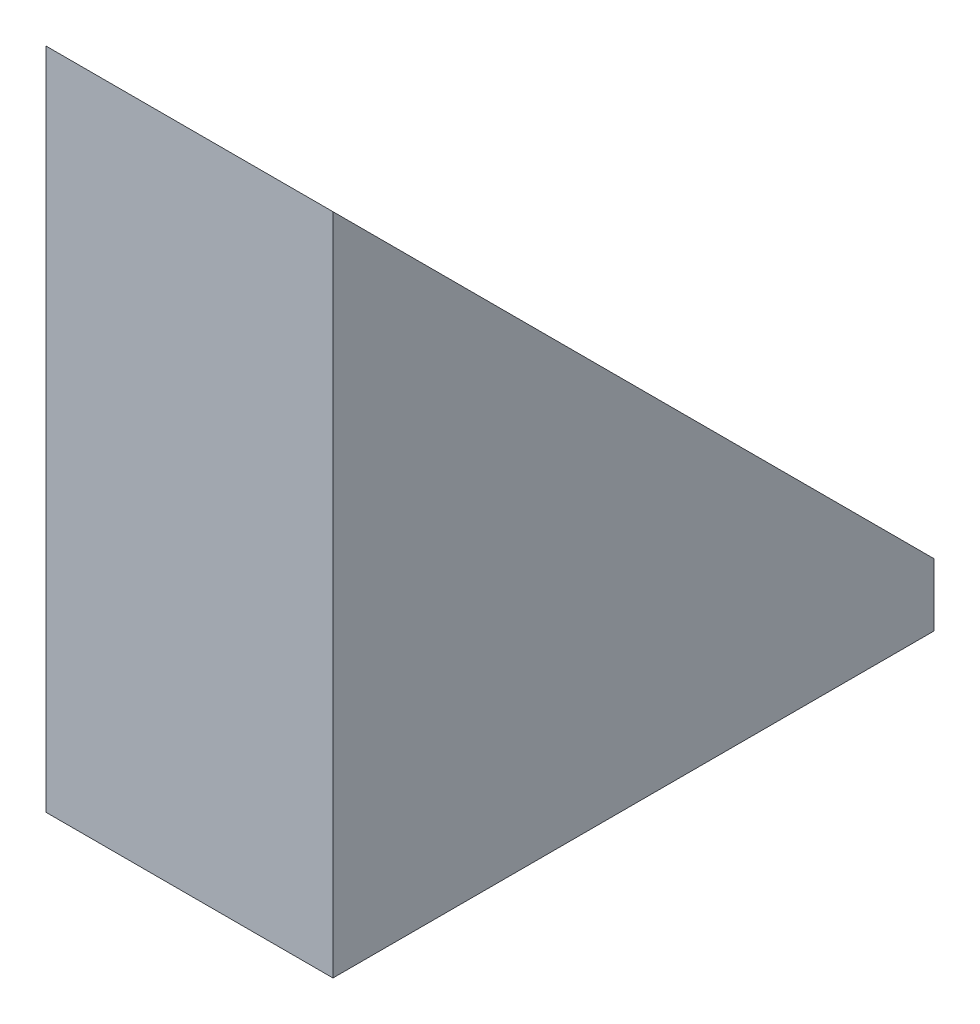
ISO-10303-21;
HEADER;
FILE_DESCRIPTION(('STEP AP214'),'2;1');
FILE_NAME('part.step','',(''),(''),'','','');
FILE_SCHEMA(('AUTOMOTIVE_DESIGN { 1 0 10303 214 1 1 1 1 }'));
ENDSEC;
DATA;
#1=APPLICATION_CONTEXT('core data for automotive mechanical design processes');
#2=APPLICATION_PROTOCOL_DEFINITION('international standard','automotive_design',2000,#1);
#3=PRODUCT_CONTEXT('',#1,'mechanical');
#4=PRODUCT('Part','Part','',(#3));
#5=PRODUCT_RELATED_PRODUCT_CATEGORY('part','',(#4));
#6=PRODUCT_DEFINITION_FORMATION('','',#4);
#7=PRODUCT_DEFINITION_CONTEXT('part definition',#1,'design');
#8=PRODUCT_DEFINITION('design','',#6,#7);
#9=PRODUCT_DEFINITION_SHAPE('','',#8);
#10=(LENGTH_UNIT() NAMED_UNIT(*) SI_UNIT(.MILLI.,.METRE.));
#11=(NAMED_UNIT(*) PLANE_ANGLE_UNIT() SI_UNIT($,.RADIAN.));
#12=(NAMED_UNIT(*) SI_UNIT($,.STERADIAN.) SOLID_ANGLE_UNIT());
#13=UNCERTAINTY_MEASURE_WITH_UNIT(LENGTH_MEASURE(1.E-05),#10,'distance_accuracy_value','');
#14=(GEOMETRIC_REPRESENTATION_CONTEXT(3) GLOBAL_UNCERTAINTY_ASSIGNED_CONTEXT((#13)) GLOBAL_UNIT_ASSIGNED_CONTEXT((#10,
#11,#12)) REPRESENTATION_CONTEXT('',''));
#15=CARTESIAN_POINT('',(0.,0.,0.));
#16=DIRECTION('',(0.,0.,1.));
#17=DIRECTION('',(1.,0.,0.));
#18=AXIS2_PLACEMENT_3D('',#15,#16,#17);
#19=CARTESIAN_POINT('',(-23149.7403514811,0.,40276.6536188858));
#20=DIRECTION('',(0.,0.,-1.));
#21=DIRECTION('',(-1.,0.,0.));
#22=AXIS2_PLACEMENT_3D('',#19,#20,#21);
#23=PLANE('',#22);
#24=DIRECTION('',(0.,-1.,0.));
#25=VECTOR('',#24,1.);
#26=CARTESIAN_POINT('',(-23229.7403514811,0.,40276.6536188858));
#27=LINE('',#26,#25);
#28=CARTESIAN_POINT('',(-23229.7403514811,5478.13982745312,40276.6536188858));
#29=VERTEX_POINT('',#28);
#30=CARTESIAN_POINT('',(-23229.7403514811,5293.1197929061,40276.6536188858));
#31=VERTEX_POINT('',#30);
#32=EDGE_CURVE('E101',#29,#31,#27,.T.);
#33=ORIENTED_EDGE('',*,*,#32,.T.);
#34=DIRECTION('',(-1.,0.,0.));
#35=VECTOR('',#34,1.);
#36=CARTESIAN_POINT('',(-23149.7403514811,5293.1197929061,40276.6536188858));
#37=LINE('',#36,#35);
#38=CARTESIAN_POINT('',(-23149.7403514811,5293.1197929061,40276.6536188858));
#39=VERTEX_POINT('',#38);
#40=EDGE_CURVE('E11',#39,#31,#37,.T.);
#41=ORIENTED_EDGE('',*,*,#40,.F.);
#42=DIRECTION('',(0.,-1.,0.));
#43=VECTOR('',#42,1.);
#44=CARTESIAN_POINT('',(-23149.7403514811,0.,40276.6536188858));
#45=LINE('',#44,#43);
#46=CARTESIAN_POINT('',(-23149.7403514811,5478.13982745312,40276.6536188858));
#47=VERTEX_POINT('',#46);
#48=EDGE_CURVE('E96',#47,#39,#45,.T.);
#49=ORIENTED_EDGE('',*,*,#48,.F.);
#50=DIRECTION('',(-1.,0.,0.));
#51=VECTOR('',#50,1.);
#52=CARTESIAN_POINT('',(-23149.7403514811,5478.13982745312,40276.6536188858));
#53=LINE('',#52,#51);
#54=EDGE_CURVE('E40',#47,#29,#53,.T.);
#55=ORIENTED_EDGE('',*,*,#54,.T.);
#56=EDGE_LOOP('',(#33,#41,#49,#55));
#57=FACE_BOUND('',#56,.T.);
#58=ADVANCED_FACE('F37',(#57),#23,.F.);
#59=CARTESIAN_POINT('',(-23149.7403514811,5293.1197929061,0.));
#60=DIRECTION('',(0.,1.,0.));
#61=DIRECTION('',(0.,0.,1.));
#62=AXIS2_PLACEMENT_3D('',#59,#60,#61);
#63=PLANE('',#62);
#64=DIRECTION('',(0.,0.,-1.));
#65=VECTOR('',#64,1.);
#66=CARTESIAN_POINT('',(-23229.7403514811,5293.1197929061,0.));
#67=LINE('',#66,#65);
#68=CARTESIAN_POINT('',(-23229.7403514811,5293.1197929061,40109.1001960557));
#69=VERTEX_POINT('',#68);
#70=EDGE_CURVE('E68',#31,#69,#67,.T.);
#71=ORIENTED_EDGE('',*,*,#70,.T.);
#72=DIRECTION('',(-1.,0.,0.));
#73=VECTOR('',#72,1.);
#74=CARTESIAN_POINT('',(-23149.7403514811,5293.1197929061,40109.1001960557));
#75=LINE('',#74,#73);
#76=CARTESIAN_POINT('',(-23149.7403514811,5293.1197929061,40109.1001960557));
#77=VERTEX_POINT('',#76);
#78=EDGE_CURVE('E46',#77,#69,#75,.T.);
#79=ORIENTED_EDGE('',*,*,#78,.F.);
#80=DIRECTION('',(0.,0.,-1.));
#81=VECTOR('',#80,1.);
#82=CARTESIAN_POINT('',(-23149.7403514811,5293.1197929061,0.));
#83=LINE('',#82,#81);
#84=EDGE_CURVE('E54',#39,#77,#83,.T.);
#85=ORIENTED_EDGE('',*,*,#84,.F.);
#86=ORIENTED_EDGE('',*,*,#40,.T.);
#87=EDGE_LOOP('',(#71,#79,#85,#86));
#88=FACE_BOUND('',#87,.T.);
#89=ADVANCED_FACE('F111',(#88),#63,.F.);
#90=CARTESIAN_POINT('',(-23149.7403514811,0.,40109.1001960557));
#91=DIRECTION('',(0.,0.,1.));
#92=DIRECTION('',(1.,0.,0.));
#93=AXIS2_PLACEMENT_3D('',#90,#91,#92);
#94=PLANE('',#93);
#95=DIRECTION('',(0.,1.,0.));
#96=VECTOR('',#95,1.);
#97=CARTESIAN_POINT('',(-23229.7403514811,0.,40109.1001960557));
#98=LINE('',#97,#96);
#99=CARTESIAN_POINT('',(-23229.7403514811,5310.58640462308,40109.1001960557));
#100=VERTEX_POINT('',#99);
#101=EDGE_CURVE('E90',#69,#100,#98,.T.);
#102=ORIENTED_EDGE('',*,*,#101,.T.);
#103=DIRECTION('',(-1.,0.,0.));
#104=VECTOR('',#103,1.);
#105=CARTESIAN_POINT('',(-23149.7403514811,5310.58640462308,40109.1001960557));
#106=LINE('',#105,#104);
#107=CARTESIAN_POINT('',(-23149.7403514811,5310.58640462308,40109.1001960557));
#108=VERTEX_POINT('',#107);
#109=EDGE_CURVE('E88',#108,#100,#106,.T.);
#110=ORIENTED_EDGE('',*,*,#109,.F.);
#111=DIRECTION('',(0.,1.,0.));
#112=VECTOR('',#111,1.);
#113=CARTESIAN_POINT('',(-23149.7403514811,0.,40109.1001960557));
#114=LINE('',#113,#112);
#115=EDGE_CURVE('E82',#77,#108,#114,.T.);
#116=ORIENTED_EDGE('',*,*,#115,.F.);
#117=ORIENTED_EDGE('',*,*,#78,.T.);
#118=EDGE_LOOP('',(#102,#110,#116,#117));
#119=FACE_BOUND('',#118,.T.);
#120=ADVANCED_FACE('F89',(#119),#94,.F.);
#121=CARTESIAN_POINT('',(-23149.7403514811,-17399.2568957164,17399.2568957165));
#122=DIRECTION('',(0.,-0.707106781186544,0.707106781186551));
#123=DIRECTION('',(0.,-0.707106781186551,-0.707106781186544));
#124=AXIS2_PLACEMENT_3D('',#121,#122,#123);
#125=PLANE('',#124);
#126=DIRECTION('',(0.,0.707106781186551,0.707106781186544));
#127=VECTOR('',#126,1.);
#128=CARTESIAN_POINT('',(-23229.7403514811,-17399.2568957164,17399.2568957165));
#129=LINE('',#128,#127);
#130=EDGE_CURVE('E104',#100,#29,#129,.T.);
#131=ORIENTED_EDGE('',*,*,#130,.T.);
#132=ORIENTED_EDGE('',*,*,#54,.F.);
#133=DIRECTION('',(0.,0.707106781186551,0.707106781186544));
#134=VECTOR('',#133,1.);
#135=CARTESIAN_POINT('',(-23149.7403514811,-17399.2568957164,17399.2568957165));
#136=LINE('',#135,#134);
#137=EDGE_CURVE('E79',#108,#47,#136,.T.);
#138=ORIENTED_EDGE('',*,*,#137,.F.);
#139=ORIENTED_EDGE('',*,*,#109,.T.);
#140=EDGE_LOOP('',(#131,#132,#138,#139));
#141=FACE_BOUND('',#140,.T.);
#142=ADVANCED_FACE('F93',(#141),#125,.F.);
#143=CARTESIAN_POINT('',(-23149.7403514811,0.,0.));
#144=DIRECTION('',(-1.,0.,0.));
#145=DIRECTION('',(0.,0.,1.));
#146=AXIS2_PLACEMENT_3D('',#143,#144,#145);
#147=PLANE('',#146);
#148=ORIENTED_EDGE('',*,*,#48,.T.);
#149=ORIENTED_EDGE('',*,*,#84,.T.);
#150=ORIENTED_EDGE('',*,*,#115,.T.);
#151=ORIENTED_EDGE('',*,*,#137,.T.);
#152=EDGE_LOOP('',(#148,#149,#150,#151));
#153=FACE_BOUND('',#152,.T.);
#154=ADVANCED_FACE('F84',(#153),#147,.F.);
#155=CARTESIAN_POINT('',(-23229.7403514811,0.,0.));
#156=DIRECTION('',(-1.,0.,0.));
#157=DIRECTION('',(0.,0.,1.));
#158=AXIS2_PLACEMENT_3D('',#155,#156,#157);
#159=PLANE('',#158);
#160=ORIENTED_EDGE('',*,*,#32,.F.);
#161=ORIENTED_EDGE('',*,*,#130,.F.);
#162=ORIENTED_EDGE('',*,*,#101,.F.);
#163=ORIENTED_EDGE('',*,*,#70,.F.);
#164=EDGE_LOOP('',(#160,#161,#162,#163));
#165=FACE_BOUND('',#164,.T.);
#166=ADVANCED_FACE('F108',(#165),#159,.T.);
#167=CLOSED_SHELL('',(#58,#89,#120,#142,#154,#166));
#168=MANIFOLD_SOLID_BREP('B2',#167);
#169=ADVANCED_BREP_SHAPE_REPRESENTATION('',(#18,#168),#14);
#170=SHAPE_DEFINITION_REPRESENTATION(#9,#169);
ENDSEC;
END-ISO-10303-21;
